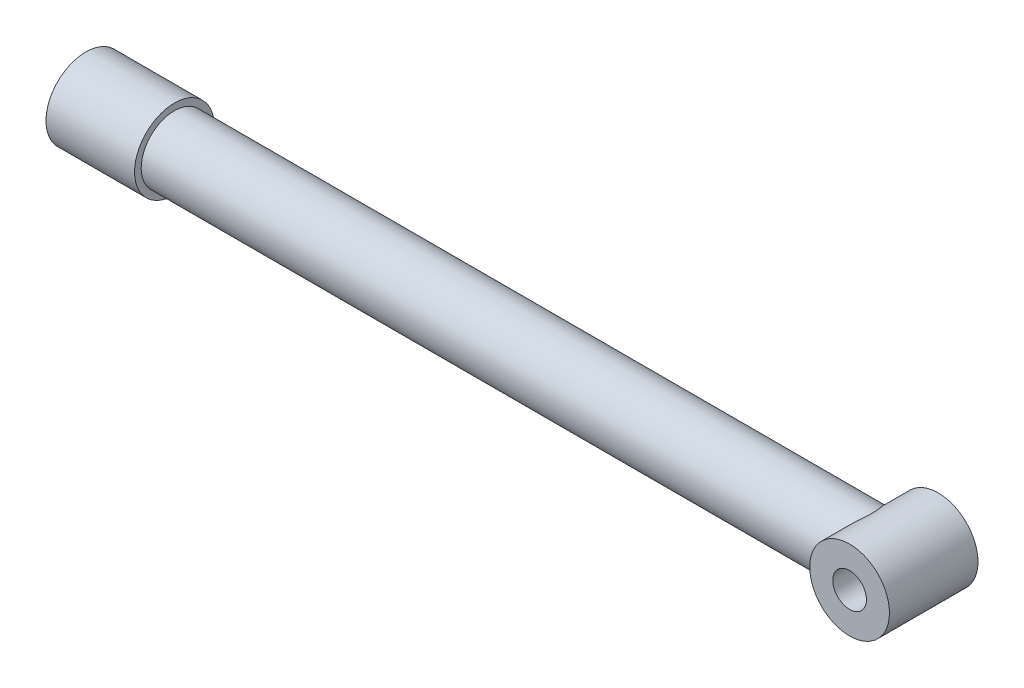
ISO-10303-21;
HEADER;
FILE_DESCRIPTION(('STEP AP214'),'2;1');
FILE_NAME('part.step','',(''),(''),'','','');
FILE_SCHEMA(('AUTOMOTIVE_DESIGN { 1 0 10303 214 1 1 1 1 }'));
ENDSEC;
DATA;
#1=APPLICATION_CONTEXT('core data for automotive mechanical design processes');
#2=APPLICATION_PROTOCOL_DEFINITION('international standard','automotive_design',2000,#1);
#3=PRODUCT_CONTEXT('',#1,'mechanical');
#4=PRODUCT('Part','Part','',(#3));
#5=PRODUCT_RELATED_PRODUCT_CATEGORY('part','',(#4));
#6=PRODUCT_DEFINITION_FORMATION('','',#4);
#7=PRODUCT_DEFINITION_CONTEXT('part definition',#1,'design');
#8=PRODUCT_DEFINITION('design','',#6,#7);
#9=PRODUCT_DEFINITION_SHAPE('','',#8);
#10=(LENGTH_UNIT() NAMED_UNIT(*) SI_UNIT(.MILLI.,.METRE.));
#11=(NAMED_UNIT(*) PLANE_ANGLE_UNIT() SI_UNIT($,.RADIAN.));
#12=(NAMED_UNIT(*) SI_UNIT($,.STERADIAN.) SOLID_ANGLE_UNIT());
#13=UNCERTAINTY_MEASURE_WITH_UNIT(LENGTH_MEASURE(1.E-05),#10,'distance_accuracy_value','');
#14=(GEOMETRIC_REPRESENTATION_CONTEXT(3) GLOBAL_UNCERTAINTY_ASSIGNED_CONTEXT((#13)) GLOBAL_UNIT_ASSIGNED_CONTEXT((#10,
#11,#12)) REPRESENTATION_CONTEXT('',''));
#15=CARTESIAN_POINT('',(0.,0.,0.));
#16=DIRECTION('',(0.,0.,1.));
#17=DIRECTION('',(1.,0.,0.));
#18=AXIS2_PLACEMENT_3D('',#15,#16,#17);
#19=CARTESIAN_POINT('',(0.,0.,0.));
#20=DIRECTION('',(-1.,0.,0.));
#21=DIRECTION('',(0.,0.,1.));
#22=AXIS2_PLACEMENT_3D('',#19,#20,#21);
#23=CYLINDRICAL_SURFACE('',#22,74.9999999999999);
#24=CARTESIAN_POINT('',(200.,0.,0.));
#25=DIRECTION('',(-1.,0.,0.));
#26=DIRECTION('',(0.,0.,1.));
#27=AXIS2_PLACEMENT_3D('',#24,#25,#26);
#28=CIRCLE('',#27,74.9999999999998);
#29=CARTESIAN_POINT('',(200.,0.,74.9999999999998));
#30=VERTEX_POINT('',#29);
#31=EDGE_CURVE('E75',#30,#30,#28,.T.);
#32=ORIENTED_EDGE('',*,*,#31,.F.);
#33=EDGE_LOOP('',(#32));
#34=FACE_BOUND('',#33,.T.);
#35=CARTESIAN_POINT('',(1735.,0.,74.9999999999999));
#36=CARTESIAN_POINT('',(1734.99999360583,-0.890858190399727,75.0000065646722));
#37=CARTESIAN_POINT('',(1735.01323031132,-1.78161747456993,74.9841248691935));
#38=CARTESIAN_POINT('',(1735.06608378754,-3.56130165667878,74.9206889799177));
#39=CARTESIAN_POINT('',(1735.10570136396,-4.45022649776036,74.8731338187884));
#40=CARTESIAN_POINT('',(1735.21109256045,-6.22429711760517,74.7465659055419));
#41=CARTESIAN_POINT('',(1735.27686726269,-7.10944273848357,74.6675518519125));
#42=CARTESIAN_POINT('',(1735.43419456346,-8.8741941597848,74.4784281526015));
#43=CARTESIAN_POINT('',(1735.52574981914,-9.75379937961504,74.3683153016503));
#44=CARTESIAN_POINT('',(1735.73416601095,-11.506076235497,74.1174338093881));
#45=CARTESIAN_POINT('',(1735.85104014988,-12.3787440068796,73.976649173745));
#46=CARTESIAN_POINT('',(1736.1094143992,-14.1150336707013,73.6650784792843));
#47=CARTESIAN_POINT('',(1736.25091480626,-14.9786554540311,73.4942920590372));
#48=CARTESIAN_POINT('',(1736.55777641808,-16.6953101071805,73.1234418807301));
#49=CARTESIAN_POINT('',(1736.72313791858,-17.5483428456103,72.923377759783));
#50=CARTESIAN_POINT('',(1737.07684267974,-19.2423239443599,72.4948014240871));
#51=CARTESIAN_POINT('',(1737.26518404675,-20.0832732940225,72.2662915533458));
#52=CARTESIAN_POINT('',(1737.66271497347,-21.7468532308557,71.7831462871858));
#53=CARTESIAN_POINT('',(1737.8717721111,-22.5695636526596,71.528676561624));
#54=CARTESIAN_POINT('',(1738.31067215743,-24.2006974064371,70.9934013086573));
#55=CARTESIAN_POINT('',(1738.54051427756,-25.0091212790517,70.7125967803786));
#56=CARTESIAN_POINT('',(1739.01993787583,-26.6106650288915,70.1255999616395));
#57=CARTESIAN_POINT('',(1739.26951755543,-27.4037862923645,69.8194099842584));
#58=CARTESIAN_POINT('',(1739.78738124022,-28.974012092462,69.1825462945913));
#59=CARTESIAN_POINT('',(1740.05566790227,-29.7511143335952,68.8518691040929));
#60=CARTESIAN_POINT('',(1740.88691315375,-32.0570989227339,67.8245798697947));
#61=CARTESIAN_POINT('',(1741.47634089138,-33.5609374024449,67.092607722516));
#62=CARTESIAN_POINT('',(1742.71682216724,-36.4968446350139,65.5418794086295));
#63=CARTESIAN_POINT('',(1743.36788879465,-37.9288980449343,64.7231048048535));
#64=CARTESIAN_POINT('',(1744.50850021663,-40.2770772470809,63.2772594319828));
#65=CARTESIAN_POINT('',(1744.9840525341,-41.2132051748074,62.6713964824808));
#66=CARTESIAN_POINT('',(1745.95693626331,-43.0496630137539,61.4244094286059));
#67=CARTESIAN_POINT('',(1746.45426305636,-43.9500004400911,60.7832927947344));
#68=CARTESIAN_POINT('',(1747.46821273861,-45.7149672911473,59.467252160506));
#69=CARTESIAN_POINT('',(1747.98484296362,-46.579582872336,58.7923152736661));
#70=CARTESIAN_POINT('',(1749.03452819888,-48.272550474702,57.410407583937));
#71=CARTESIAN_POINT('',(1749.5675841317,-49.1009004526405,56.7034349806798));
#72=CARTESIAN_POINT('',(1750.64871248675,-50.7231558019671,55.2570839545224));
#73=CARTESIAN_POINT('',(1751.19681878034,-51.516970939548,54.5176297259359));
#74=CARTESIAN_POINT('',(1752.30402576862,-53.0679106262517,53.0091229817846));
#75=CARTESIAN_POINT('',(1752.86312630644,-53.8250356983419,52.240070888378));
#76=CARTESIAN_POINT('',(1753.98945934437,-55.3024941253849,50.6733987578555));
#77=CARTESIAN_POINT('',(1754.55669069899,-56.0228325989228,49.8757827216218));
#78=CARTESIAN_POINT('',(1755.69648984487,-57.4268322392658,48.2525696955304));
#79=CARTESIAN_POINT('',(1756.269057691,-58.1104930284205,47.4269724177076));
#80=CARTESIAN_POINT('',(1757.42706481228,-59.4533332062403,45.7328212185813));
#81=CARTESIAN_POINT('',(1758.01254713861,-60.1118310733573,44.8637565097349));
#82=CARTESIAN_POINT('',(1759.18252162071,-61.3906390174382,43.0973130712857));
#83=CARTESIAN_POINT('',(1759.76701376978,-62.0109488365384,42.1999341505538));
#84=CARTESIAN_POINT('',(1760.93151271706,-63.2133656849564,40.3765216512356));
#85=CARTESIAN_POINT('',(1761.51151788179,-63.7954593302255,39.4504781990893));
#86=CARTESIAN_POINT('',(1762.66273366669,-64.9208217946784,37.5697722119378));
#87=CARTESIAN_POINT('',(1763.23394439402,-65.464091087166,36.6151100260222));
#88=CARTESIAN_POINT('',(1764.36162318151,-66.5099780569317,34.6789646249734));
#89=CARTESIAN_POINT('',(1764.91812309669,-67.0126894173575,33.6975506593872));
#90=CARTESIAN_POINT('',(1766.01259151048,-67.9780705481447,31.7050083421357));
#91=CARTESIAN_POINT('',(1766.55055902474,-68.4407381935595,30.6938784173825));
#92=CARTESIAN_POINT('',(1767.6015402537,-69.3245110484923,28.641912652945));
#93=CARTESIAN_POINT('',(1768.11457146629,-69.7456456218262,27.6010984809572));
#94=CARTESIAN_POINT('',(1769.10904454888,-70.5450782887257,25.4885689197051));
#95=CARTESIAN_POINT('',(1769.59049218487,-70.9233842104176,24.416859222531));
#96=CARTESIAN_POINT('',(1770.5574095196,-71.6687596560138,22.1394732679743));
#97=CARTESIAN_POINT('',(1771.03899181122,-72.0314193841978,20.9306826994214));
#98=CARTESIAN_POINT('',(1771.94293478505,-72.6998210753984,18.4757639197167));
#99=CARTESIAN_POINT('',(1772.36530346877,-73.0055707304649,17.2296407809617));
#100=CARTESIAN_POINT('',(1773.13693408139,-73.5557394522424,14.7043907038731));
#101=CARTESIAN_POINT('',(1773.48634608819,-73.800284631767,13.4253377207366));
#102=CARTESIAN_POINT('',(1774.09970651544,-74.2246571135214,10.836084770843));
#103=CARTESIAN_POINT('',(1774.36365566694,-74.4044849693383,9.52588507061465));
#104=CARTESIAN_POINT('',(1774.79653935441,-74.6972714236726,6.86516424967096));
#105=CARTESIAN_POINT('',(1774.96424204964,-74.8093640104216,5.51434361386447));
#106=CARTESIAN_POINT('',(1775.19027944435,-74.9600601783092,2.79947489969748));
#107=CARTESIAN_POINT('',(1775.2486243704,-74.998670631117,1.43542807017393));
#108=CARTESIAN_POINT('',(1775.25252985381,-75.0012616664914,-1.29291241333085));
#109=CARTESIAN_POINT('',(1775.19809016812,-74.9652420882301,-2.65720606783765));
#110=CARTESIAN_POINT('',(1774.97964633137,-74.8196560474258,-5.37300505572056));
#111=CARTESIAN_POINT('',(1774.81562883437,-74.7100806262076,-6.72450881102561));
#112=CARTESIAN_POINT('',(1774.3691886328,-74.4083266087523,-9.5147385123352));
#113=CARTESIAN_POINT('',(1774.07807142965,-74.2100490868164,-10.9513982271858));
#114=CARTESIAN_POINT('',(1773.39396190408,-73.7359412315258,-13.7869111174389));
#115=CARTESIAN_POINT('',(1773.00095353118,-73.4600986790968,-15.1857582980199));
#116=CARTESIAN_POINT('',(1772.12966628761,-72.8355372784456,-17.9440910715829));
#117=CARTESIAN_POINT('',(1771.65114923319,-72.4866143859322,-19.3034540590487));
#118=CARTESIAN_POINT('',(1770.62667668022,-71.7213368858453,-21.9768898118502));
#119=CARTESIAN_POINT('',(1770.08071469034,-71.3049757864051,-23.2909582021653));
#120=CARTESIAN_POINT('',(1769.05415180929,-70.5010334959811,-25.6082712728805));
#121=CARTESIAN_POINT('',(1768.58317147396,-70.1251176212857,-26.6199023384864));
#122=CARTESIAN_POINT('',(1767.61472209306,-69.3348428384365,-28.6152262356151));
#123=CARTESIAN_POINT('',(1767.11724967575,-68.9204790318601,-29.5989154863273));
#124=CARTESIAN_POINT('',(1766.10140958134,-68.054403535938,-31.5393012510223));
#125=CARTESIAN_POINT('',(1765.58303197648,-67.6026739921706,-32.495984564529));
#126=CARTESIAN_POINT('',(1764.53064296829,-66.6629920016483,-34.3824943000731));
#127=CARTESIAN_POINT('',(1763.99663213984,-66.1750408858584,-35.3123217071909));
#128=CARTESIAN_POINT('',(1762.91663413555,-65.1629048195095,-37.146935947218));
#129=CARTESIAN_POINT('',(1762.37063186522,-64.6386721750583,-38.0516875429799));
#130=CARTESIAN_POINT('',(1761.27124312282,-63.5550259675181,-39.83525460095));
#131=CARTESIAN_POINT('',(1760.71785660937,-62.9956122072284,-40.714069917737));
#132=CARTESIAN_POINT('',(1759.60731482995,-61.8420377136799,-42.4457831502217));
#133=CARTESIAN_POINT('',(1759.050160401,-61.2478844870307,-43.2986866049474));
#134=CARTESIAN_POINT('',(1757.93513655507,-60.0249021311513,-44.978780655172));
#135=CARTESIAN_POINT('',(1757.37726713409,-59.3960728065933,-45.8059711057904));
#136=CARTESIAN_POINT('',(1756.23459491895,-58.0699981275553,-47.4770666909604));
#137=CARTESIAN_POINT('',(1755.64991106872,-57.3708945105391,-48.3195797890107));
#138=CARTESIAN_POINT('',(1754.48620911338,-55.9344236448117,-49.9754092883336));
#139=CARTESIAN_POINT('',(1753.90719103005,-55.1970562490158,-50.7887255773544));
#140=CARTESIAN_POINT('',(1752.75778966588,-53.6839441209614,-52.3855336083897));
#141=CARTESIAN_POINT('',(1752.1874077526,-52.9081933918887,-53.1690206559871));
#142=CARTESIAN_POINT('',(1751.05833399707,-51.3184235799533,-54.7050369973918));
#143=CARTESIAN_POINT('',(1750.4996423167,-50.5044039676804,-55.4575658626546));
#144=CARTESIAN_POINT('',(1749.3978897704,-48.8396906219057,-56.9290475503942));
#145=CARTESIAN_POINT('',(1748.85480217139,-47.989066727207,-57.6480592961789));
#146=CARTESIAN_POINT('',(1747.7861288759,-46.2499696110202,-59.0524292634196));
#147=CARTESIAN_POINT('',(1747.26054205602,-45.3614988273463,-59.7377896463422));
#148=CARTESIAN_POINT('',(1746.22994301304,-43.5472844076407,-61.072922891836));
#149=CARTESIAN_POINT('',(1745.72492277715,-42.6215555723935,-61.7227096485994));
#150=CARTESIAN_POINT('',(1744.73808287952,-40.732793060747,-62.9851592453571));
#151=CARTESIAN_POINT('',(1744.25626893399,-39.7697502974676,-63.5978129481832));
#152=CARTESIAN_POINT('',(1743.07954962281,-37.3060044479162,-65.0865706523571));
#153=CARTESIAN_POINT('',(1742.40145236073,-35.781845527402,-65.9374689284979));
#154=CARTESIAN_POINT('',(1741.11581347358,-32.6542503976722,-67.5409966580156));
#155=CARTESIAN_POINT('',(1740.50825519976,-31.0508330230893,-68.2936493047488));
#156=CARTESIAN_POINT('',(1739.65771551319,-28.5910455205154,-69.3422461607241));
#157=CARTESIAN_POINT('',(1739.38433953401,-27.7620212523806,-69.6783761950588));
#158=CARTESIAN_POINT('',(1738.85907711185,-26.0866191634127,-70.3227806768454));
#159=CARTESIAN_POINT('',(1738.60718719172,-25.2402441780989,-70.6310596319965));
#160=CARTESIAN_POINT('',(1738.12608554902,-23.5310714172204,-71.2187157472113));
#161=CARTESIAN_POINT('',(1737.89687606179,-22.6682720328798,-71.4980900586283));
#162=CARTESIAN_POINT('',(1737.46233461677,-20.9275386050973,-72.0268391168136));
#163=CARTESIAN_POINT('',(1737.25700369427,-20.0496039073426,-72.2762125628818));
#164=CARTESIAN_POINT('',(1736.86984925125,-18.273185584629,-72.7457301076251));
#165=CARTESIAN_POINT('',(1736.68822087041,-17.3745952745065,-72.9656319263471));
#166=CARTESIAN_POINT('',(1736.35141205953,-15.5651753141046,-73.3729190900226));
#167=CARTESIAN_POINT('',(1736.19623120411,-14.6543458609261,-73.5603049579436));
#168=CARTESIAN_POINT('',(1735.91324212529,-12.8221990613449,-73.9016883798035));
#169=CARTESIAN_POINT('',(1735.78543466866,-11.9008814219109,-74.0556849984528));
#170=CARTESIAN_POINT('',(1735.55799265563,-10.0497231203051,-74.3295263948367));
#171=CARTESIAN_POINT('',(1735.45835809442,-9.11988245959037,-74.4493711784096));
#172=CARTESIAN_POINT('',(1735.2879433958,-7.25423036558703,-74.6542452413002));
#173=CARTESIAN_POINT('',(1735.21714828022,-6.31842228872229,-74.7392925932404));
#174=CARTESIAN_POINT('',(1735.10480001124,-4.44251327578992,-74.8742170433437));
#175=CARTESIAN_POINT('',(1735.06324704964,-3.50241231160288,-74.9240939107985));
#176=CARTESIAN_POINT('',(1735.00966118274,-1.62024793990289,-74.9884084095682));
#177=CARTESIAN_POINT('',(1734.99762550467,-0.67818472503879,-75.0028493696179));
#178=CARTESIAN_POINT('',(1735.00314751349,1.20571287057665,-74.9962230077101));
#179=CARTESIAN_POINT('',(1735.02070434409,2.1475472571606,-74.975156713175));
#180=CARTESIAN_POINT('',(1735.0814120306,3.915801589101,-74.902288367009));
#181=CARTESIAN_POINT('',(1735.12123772839,4.7425049293008,-74.8544792297342));
#182=CARTESIAN_POINT('',(1735.22350810366,6.39255905124008,-74.7316509767426));
#183=CARTESIAN_POINT('',(1735.28595468038,7.2159095456069,-74.6566295763128));
#184=CARTESIAN_POINT('',(1735.43313714074,8.85754567030661,-74.4796974451217));
#185=CARTESIAN_POINT('',(1735.51786869054,9.67583225380561,-74.3777919426208));
#186=CARTESIAN_POINT('',(1735.70921471405,11.306166983224,-74.1474776515776));
#187=CARTESIAN_POINT('',(1735.81583131499,12.1182145147416,-74.0190662866592));
#188=CARTESIAN_POINT('',(1736.05042431236,13.7346212369416,-73.7362411782231));
#189=CARTESIAN_POINT('',(1736.17839960885,14.5389808212789,-73.5818287736866));
#190=CARTESIAN_POINT('',(1736.45510821168,16.138819817097,-73.247570694004));
#191=CARTESIAN_POINT('',(1736.60384336248,16.9342984327267,-73.0677227589291));
#192=CARTESIAN_POINT('',(1737.08018032076,19.3055196571069,-72.4909786239117));
#193=CARTESIAN_POINT('',(1737.43796239014,20.8663809435798,-72.0568234542264));
#194=CARTESIAN_POINT('',(1738.23303894434,23.9599582851523,-71.0885564508912));
#195=CARTESIAN_POINT('',(1738.67132665717,25.4920249018549,-70.5531932531738));
#196=CARTESIAN_POINT('',(1739.38049267166,27.74746263732,-69.6830550274554));
#197=CARTESIAN_POINT('',(1739.62551533968,28.4921957982151,-69.3818123913277));
#198=CARTESIAN_POINT('',(1740.13194454816,29.9669996816855,-68.7576912411989));
#199=CARTESIAN_POINT('',(1740.39335310258,30.6970685872745,-68.4348100672901));
#200=CARTESIAN_POINT('',(1741.20074396773,32.8642822380754,-67.434932849334));
#201=CARTESIAN_POINT('',(1741.76992861234,34.2785512900032,-66.7266576536846));
#202=CARTESIAN_POINT('',(1742.96253732782,37.0421482728449,-65.2330248794708));
#203=CARTESIAN_POINT('',(1743.58597227886,38.3914630921845,-64.4476518344722));
#204=CARTESIAN_POINT('',(1744.70151640257,40.6605833424829,-63.0315848410118));
#205=CARTESIAN_POINT('',(1745.18258190864,41.5964456853992,-62.4177623776756));
#206=CARTESIAN_POINT('',(1746.16632998576,43.4319745220933,-61.1547578566969));
#207=CARTESIAN_POINT('',(1746.66900868259,44.3316474473926,-60.5055821306778));
#208=CARTESIAN_POINT('',(1747.69347374999,46.094914610935,-59.1733085502858));
#209=CARTESIAN_POINT('',(1748.21526802881,46.9584935932191,-58.4901966136917));
#210=CARTESIAN_POINT('',(1749.27503129004,48.6489914597185,-57.0918469824338));
#211=CARTESIAN_POINT('',(1749.81300104452,49.4759085893232,-56.3766077534712));
#212=CARTESIAN_POINT('',(1750.90385645663,51.0951775790398,-54.9133587140955));
#213=CARTESIAN_POINT('',(1751.45677957178,51.8874264673553,-54.1652629693572));
#214=CARTESIAN_POINT('',(1752.57329334488,53.4348427224347,-52.6393231340171));
#215=CARTESIAN_POINT('',(1753.13688387533,54.1900105320211,-51.8614793988637));
#216=CARTESIAN_POINT('',(1754.27180384136,55.6631535627925,-50.2770654234478));
#217=CARTESIAN_POINT('',(1754.84313206323,56.3811345336732,-49.470499656823));
#218=CARTESIAN_POINT('',(1755.99067563225,57.7800275113222,-47.829187293026));
#219=CARTESIAN_POINT('',(1756.56689102636,58.460939161401,-46.9944404248141));
#220=CARTESIAN_POINT('',(1757.73143991024,59.7974950364994,-45.2820089720696));
#221=CARTESIAN_POINT('',(1758.31980575609,60.4524691966841,-44.4038233670543));
#222=CARTESIAN_POINT('',(1759.49490411792,61.7238340470819,-42.6188801400728));
#223=CARTESIAN_POINT('',(1760.08163662215,62.3402244602702,-41.7121223130329));
#224=CARTESIAN_POINT('',(1761.24987194808,63.5343929701284,-39.8696200497105));
#225=CARTESIAN_POINT('',(1761.83137272344,64.1121564817817,-38.9338648574026));
#226=CARTESIAN_POINT('',(1762.98467179164,65.2283912561971,-37.0333827618349));
#227=CARTESIAN_POINT('',(1763.5564702105,65.7668630295438,-36.0686562352791));
#228=CARTESIAN_POINT('',(1764.6840736774,66.8024956162222,-34.112289589846));
#229=CARTESIAN_POINT('',(1765.23991733132,67.2997628313288,-33.1207281578333));
#230=CARTESIAN_POINT('',(1766.33178595126,68.2536898603624,-31.1074701928449));
#231=CARTESIAN_POINT('',(1766.86780979369,68.710347374173,-30.0857719572923));
#232=CARTESIAN_POINT('',(1767.91332832775,69.5814234141006,-28.0123014447488));
#233=CARTESIAN_POINT('',(1768.42284301551,69.9958740100996,-26.9605527908332));
#234=CARTESIAN_POINT('',(1769.40843244053,70.7811739566228,-24.8257655359758));
#235=CARTESIAN_POINT('',(1769.88451371592,71.1520318416025,-23.7427331115758));
#236=CARTESIAN_POINT('',(1770.831149632,71.8757130808422,-21.4576266149494));
#237=CARTESIAN_POINT('',(1771.29827305436,72.2247749916504,-20.2529226086267));
#238=CARTESIAN_POINT('',(1772.1720957267,72.8663607554869,-17.8070606774411));
#239=CARTESIAN_POINT('',(1772.57880330202,73.1588924001079,-16.5659078035466));
#240=CARTESIAN_POINT('',(1773.31813005963,73.6830345684437,-14.0518728803488));
#241=CARTESIAN_POINT('',(1773.65090646223,73.9147745638728,-12.7790646888049));
#242=CARTESIAN_POINT('',(1774.23046187404,74.3140521438726,-10.2038622975775));
#243=CARTESIAN_POINT('',(1774.47724192084,74.4815905030862,-8.90146845506904));
#244=CARTESIAN_POINT('',(1774.87561623858,74.7502856576446,-6.25924931851869));
#245=CARTESIAN_POINT('',(1775.0260498954,74.8506336915455,-4.91916347704064));
#246=CARTESIAN_POINT('',(1775.21885650995,74.9790072406208,-2.22777280448192));
#247=CARTESIAN_POINT('',(1775.26123854009,75.0070388277551,-0.876468924868412));
#248=CARTESIAN_POINT('',(1775.23549749281,74.9899626752168,1.82490985025215));
#249=CARTESIAN_POINT('',(1775.16735013411,74.9448388646474,3.17498441050576));
#250=CARTESIAN_POINT('',(1774.92443621814,74.7827432489087,5.86111843644855));
#251=CARTESIAN_POINT('',(1774.7496555748,74.6657619514844,7.1971760267998));
#252=CARTESIAN_POINT('',(1774.27894842312,74.3469152143914,9.98543407262301));
#253=CARTESIAN_POINT('',(1773.97212632,74.1373536186976,11.4348979464841));
#254=CARTESIAN_POINT('',(1773.25632380938,73.6395340772299,14.29429682411));
#255=CARTESIAN_POINT('',(1772.84732480814,73.3512618071235,15.7042245812581));
#256=CARTESIAN_POINT('',(1771.94437757315,72.700832023437,18.4832863979606));
#257=CARTESIAN_POINT('',(1771.45019415343,72.3384694237424,19.8522948663122));
#258=CARTESIAN_POINT('',(1770.39512742583,71.5453918521927,22.5438660969454));
#259=CARTESIAN_POINT('',(1769.83423822609,71.1146708413795,23.8664247431111));
#260=CARTESIAN_POINT('',(1768.78113207339,70.2836579654289,26.1994538324334));
#261=CARTESIAN_POINT('',(1768.29832212241,69.8951507145907,27.2184451928627));
#262=CARTESIAN_POINT('',(1767.30679651048,69.0789875882514,29.2278911188011));
#263=CARTESIAN_POINT('',(1766.7980775787,68.6513267644337,30.2183420564532));
#264=CARTESIAN_POINT('',(1765.76037883652,67.757924536969,32.171690478186));
#265=CARTESIAN_POINT('',(1765.23138945403,67.2921650216322,33.1345745602039));
#266=CARTESIAN_POINT('',(1764.15845699049,66.323668094574,35.0329333938733));
#267=CARTESIAN_POINT('',(1763.61451445833,65.8209320390324,35.9684091490156));
#268=CARTESIAN_POINT('',(1762.51536088157,64.7784256080526,37.8137552548451));
#269=CARTESIAN_POINT('',(1761.96013578933,64.2386067837216,38.7235898306171));
#270=CARTESIAN_POINT('',(1760.84305679917,63.1229737039889,40.5167270268659));
#271=CARTESIAN_POINT('',(1760.28120286153,62.5471592327492,41.4000294882033));
#272=CARTESIAN_POINT('',(1759.15452440796,61.3599458353983,43.1400752768837));
#273=CARTESIAN_POINT('',(1758.58970055251,60.7485545400266,43.9968242396085));
#274=CARTESIAN_POINT('',(1757.4601836346,59.4902348489063,45.6839068361607));
#275=CARTESIAN_POINT('',(1756.89549057269,58.8433063089715,46.5142403627906));
#276=CARTESIAN_POINT('',(1755.74153112804,57.481299974877,48.1883924109552));
#277=CARTESIAN_POINT('',(1755.15242164698,56.7644353655917,49.0308666783466));
#278=CARTESIAN_POINT('',(1753.98088673746,55.2916898274977,50.6858561253578));
#279=CARTESIAN_POINT('',(1753.39846137037,54.5358085408526,51.498371030092));
#280=CARTESIAN_POINT('',(1752.24334738606,52.9849458340759,53.0926772422969));
#281=CARTESIAN_POINT('',(1751.67065991307,52.1899598611389,53.8744649531675));
#282=CARTESIAN_POINT('',(1750.53806802618,50.5609034086353,55.4061833672287));
#283=CARTESIAN_POINT('',(1749.97816502953,49.7268286267752,56.1561105463025));
#284=CARTESIAN_POINT('',(1748.87526932998,48.0213974385445,57.6212347641257));
#285=CARTESIAN_POINT('',(1748.33224627398,47.1501155487552,58.3364956109421));
#286=CARTESIAN_POINT('',(1747.26499316425,45.3690042638806,59.7321813067613));
#287=CARTESIAN_POINT('',(1746.74076262265,44.4591758708069,60.4126070602837));
#288=CARTESIAN_POINT('',(1745.7142330856,42.6015593826238,61.7365983294859));
#289=CARTESIAN_POINT('',(1745.21192769807,41.6537825076299,62.3801746055703));
#290=CARTESIAN_POINT('',(1744.23218891478,39.7207117135541,63.628522277774));
#291=CARTESIAN_POINT('',(1743.7547536168,38.7354206738001,64.2332966425311));
#292=CARTESIAN_POINT('',(1742.60443003221,36.2443527742644,65.6833934744148));
#293=CARTESIAN_POINT('',(1741.94817262658,34.7164780728101,66.5042605817841));
#294=CARTESIAN_POINT('',(1740.70707674385,31.5838570468608,68.0478317961649));
#295=CARTESIAN_POINT('',(1740.12223152284,29.9791180011214,68.770545173193));
#296=CARTESIAN_POINT('',(1739.30643617243,27.5201546200804,69.7740968800167));
#297=CARTESIAN_POINT('',(1739.04483996042,26.6921910767775,70.0950847542024));
#298=CARTESIAN_POINT('',(1738.54319623126,25.0196522071403,70.7093372794465));
#299=CARTESIAN_POINT('',(1738.30314662715,24.1750784993246,71.0026046156234));
#300=CARTESIAN_POINT('',(1737.84578175223,22.4704453630091,71.5603467554634));
#301=CARTESIAN_POINT('',(1737.62846535666,21.6103867031276,71.8248229836485));
#302=CARTESIAN_POINT('',(1737.21768657198,19.8761111699739,72.3239560406934));
#303=CARTESIAN_POINT('',(1737.02422327099,19.0018948393754,72.5586140094728));
#304=CARTESIAN_POINT('',(1736.54286323004,16.660087175569,73.1416941525058));
#305=CARTESIAN_POINT('',(1736.27675431542,15.1811243093772,73.4631769738318));
#306=CARTESIAN_POINT('',(1735.8173528209,12.1957506827363,74.0173529805729));
#307=CARTESIAN_POINT('',(1735.62405079414,10.68934350986,74.2500576852072));
#308=CARTESIAN_POINT('',(1735.31340448842,7.65745674107267,74.6236972907827));
#309=CARTESIAN_POINT('',(1735.1960568606,6.13197798905995,74.7646362377219));
#310=CARTESIAN_POINT('',(1735.03935543385,3.07090236753309,74.9527875744933));
#311=CARTESIAN_POINT('',(1735.00001101971,1.53530430283094,74.9999886864489));
#312=CARTESIAN_POINT('',(1735.,0.,74.9999999999999));
#313=B_SPLINE_CURVE_WITH_KNOTS('',3,(#35,#36,#37,#38,#39,#40,#41,#42,#43,#44,#45,#46,#47,#48,
#49,#50,#51,#52,#53,#54,#55,#56,#57,#58,#59,#60,#61,#62,#63,#64,#65,#66,#67,#68,#69,#70,#71,#72,
#73,#74,#75,#76,#77,#78,#79,#80,#81,#82,#83,#84,#85,#86,#87,#88,#89,#90,#91,#92,#93,#94,#95,#96,
#97,#98,#99,#100,#101,#102,#103,#104,#105,#106,#107,#108,#109,#110,#111,#112,#113,#114,#115,
#116,#117,#118,#119,#120,#121,#122,#123,#124,#125,#126,#127,#128,#129,#130,#131,#132,#133,#134,
#135,#136,#137,#138,#139,#140,#141,#142,#143,#144,#145,#146,#147,#148,#149,#150,#151,#152,#153,
#154,#155,#156,#157,#158,#159,#160,#161,#162,#163,#164,#165,#166,#167,#168,#169,#170,#171,#172,
#173,#174,#175,#176,#177,#178,#179,#180,#181,#182,#183,#184,#185,#186,#187,#188,#189,#190,#191,
#192,#193,#194,#195,#196,#197,#198,#199,#200,#201,#202,#203,#204,#205,#206,#207,#208,#209,#210,
#211,#212,#213,#214,#215,#216,#217,#218,#219,#220,#221,#222,#223,#224,#225,#226,#227,#228,#229,
#230,#231,#232,#233,#234,#235,#236,#237,#238,#239,#240,#241,#242,#243,#244,#245,#246,#247,#248,
#249,#250,#251,#252,#253,#254,#255,#256,#257,#258,#259,#260,#261,#262,#263,#264,#265,#266,#267,
#268,#269,#270,#271,#272,#273,#274,#275,#276,#277,#278,#279,#280,#281,#282,#283,#284,#285,#286,
#287,#288,#289,#290,#291,#292,#293,#294,#295,#296,#297,#298,#299,#300,#301,#302,#303,#304,#305,
#306,#307,#308,#309,#310,#311,#312),.UNSPECIFIED.,.T.,.F.,(4,2,2,2,2,2,2,2,2,2,2,2,2,2,2,2,2,2,
2,2,2,2,2,2,2,2,2,2,2,2,2,2,2,2,2,2,2,2,2,2,2,2,2,2,2,2,2,2,2,2,2,2,2,2,2,2,2,2,2,2,2,2,2,2,2,2,
2,2,2,2,2,2,2,2,2,2,2,2,2,2,2,2,2,2,2,2,2,2,2,2,2,2,2,2,2,2,2,2,2,2,2,2,2,2,2,2,2,2,2,2,2,2,2,2,
2,2,2,2,2,2,2,2,2,2,2,2,2,2,2,2,2,2,2,2,2,2,2,2,4),(0.,2.67216416265691,5.34440993901757,
8.01676628259472,10.6893981593524,13.3634270763591,16.0374882094253,18.711582489381,
21.3854565623436,24.0432234587753,26.7008895619219,29.3583137685985,32.0161161678083,
37.3307989796573,42.646612920445,46.2821944679082,49.9170085571638,53.5532183049228,
57.1896326572577,60.8350385726247,64.480392512352,68.1252378380544,71.7701206855713,
75.4820402668571,79.1939849100034,82.90722268914,86.6204151928261,90.3247693620706,
94.0293199849669,97.7312324327156,101.432467156933,105.482105851445,109.531196792687,
113.571874524974,117.612517692802,121.7037848456,125.794669385445,129.885562741164,
133.976954434394,138.407787287454,142.839318535601,147.283391860394,151.727893243682,
155.259157191809,158.790871656672,162.324283534002,165.857565639994,169.395584035365,
172.933622264165,176.470898788219,180.008195239517,183.730675039042,187.453169148705,
191.176246689469,194.899375750308,198.615691570316,202.331768373884,206.046383258997,
209.761908503049,215.374550724194,220.985865534098,223.791423741609,226.596527052766,
229.40190655319,232.207407638232,235.034717002629,237.861980890027,240.689323963673,
243.516666553992,246.342538847423,249.168429677597,251.994055042537,254.819598647822,
257.305976853202,259.792563860612,262.278667647364,264.765013197861,267.251230747606,
269.737669334941,274.709523847635,279.74743306671,282.266603228135,284.786083627458,
289.824651679053,294.864232580594,298.517667045482,302.170449333483,305.82476025709,
309.47924588508,313.143936658118,316.808583656728,320.472662338827,324.136776271312,
327.866448835432,331.596148174901,335.327247938271,339.058299208455,342.779394374324,
346.500700167394,350.219156984305,353.936884595652,357.949387808165,361.961337580432,
365.964672181974,369.96795847863,374.018604832133,378.068911067119,382.120107200543,
386.171838605381,390.653919675811,395.136816971753,399.632295378674,404.128171149028,
407.704809576241,411.281900652708,414.860702232596,418.439372619017,422.022810911748,
425.606270693641,429.188964685639,432.771673214853,436.530534229934,440.289429725055,
444.048763894314,447.808512809377,451.561055904236,455.313501511988,459.064845721568,
462.815902582045,468.373828482194,473.931229104832,476.707762067515,479.484025808274,
482.260152122981,485.036172277452,489.641624740836,494.246479429941,498.851131074953,
503.456336685688),.UNSPECIFIED.);
#314=CARTESIAN_POINT('',(1735.,0.,74.9999999999999));
#315=VERTEX_POINT('',#314);
#316=EDGE_CURVE('E11',#315,#315,#313,.T.);
#317=ORIENTED_EDGE('',*,*,#316,.F.);
#318=EDGE_LOOP('',(#317));
#319=FACE_BOUND('',#318,.T.);
#320=ADVANCED_FACE('F33',(#34,#319),#23,.T.);
#321=CARTESIAN_POINT('',(0.,0.,0.));
#322=DIRECTION('',(-1.,0.,0.));
#323=DIRECTION('',(0.,0.,1.));
#324=AXIS2_PLACEMENT_3D('',#321,#322,#323);
#325=CYLINDRICAL_SURFACE('',#324,50.9999999999995);
#326=CARTESIAN_POINT('',(0.,0.,0.));
#327=DIRECTION('',(-1.,0.,0.));
#328=DIRECTION('',(0.,0.,1.));
#329=AXIS2_PLACEMENT_3D('',#326,#327,#328);
#330=CIRCLE('',#329,50.9999999999989);
#331=CARTESIAN_POINT('',(0.,0.,50.9999999999989));
#332=VERTEX_POINT('',#331);
#333=EDGE_CURVE('E66',#332,#332,#330,.T.);
#334=ORIENTED_EDGE('',*,*,#333,.T.);
#335=EDGE_LOOP('',(#334));
#336=FACE_BOUND('',#335,.T.);
#337=CARTESIAN_POINT('',(1750.,49.7493718553313,-11.2249721603179));
#338=CARTESIAN_POINT('',(1749.8952033153,49.5913628520777,-11.9253288343426));
#339=CARTESIAN_POINT('',(1749.7814686798,49.4188395714794,-12.6210200386141));
#340=CARTESIAN_POINT('',(1749.53750751067,49.0455147075413,-14.0017321957628));
#341=CARTESIAN_POINT('',(1749.40728351955,48.8447174832296,-14.6867547753884));
#342=CARTESIAN_POINT('',(1749.13184045356,48.4157731263372,-16.044287621711));
#343=CARTESIAN_POINT('',(1748.98663740515,48.187655183648,-16.7168103711649));
#344=CARTESIAN_POINT('',(1748.68259620364,47.7046678181159,-18.0490117726604));
#345=CARTESIAN_POINT('',(1748.5237575303,47.4497973745094,-18.7086899334668));
#346=CARTESIAN_POINT('',(1748.03046421585,46.648504472935,-20.6613224045983));
#347=CARTESIAN_POINT('',(1747.67794139938,46.0634187292058,-21.934118020456));
#348=CARTESIAN_POINT('',(1746.93664573265,44.7956670461627,-24.419161613437));
#349=CARTESIAN_POINT('',(1746.54786261535,44.1129734400651,-25.6313922916172));
#350=CARTESIAN_POINT('',(1745.74739453835,42.6580706704845,-27.9856379917374));
#351=CARTESIAN_POINT('',(1745.33580723342,41.8862298602213,-29.1279140777704));
#352=CARTESIAN_POINT('',(1744.4994489717,40.2554455865877,-31.3431133219757));
#353=CARTESIAN_POINT('',(1744.07467916968,39.3965097377663,-32.4160425296032));
#354=CARTESIAN_POINT('',(1743.22172010364,37.593998204418,-34.4903225785894));
#355=CARTESIAN_POINT('',(1742.79352626494,36.6502815611494,-35.4915490470691));
#356=CARTESIAN_POINT('',(1741.94448795291,34.6832733435696,-37.4160907765675));
#357=CARTESIAN_POINT('',(1741.52364403021,33.6599758384432,-38.339400220057));
#358=CARTESIAN_POINT('',(1740.66326567136,31.4459104876112,-40.179628449506));
#359=CARTESIAN_POINT('',(1740.225269149,30.2483140577951,-41.0890682607458));
#360=CARTESIAN_POINT('',(1739.38122203669,27.7693742261069,-42.8034096264909));
#361=CARTESIAN_POINT('',(1738.97517343752,26.4880256144533,-43.608304668497));
#362=CARTESIAN_POINT('',(1738.39887440972,24.5095372343277,-44.7309471185881));
#363=CARTESIAN_POINT('',(1738.21227596197,23.8407895315885,-45.0909719490137));
#364=CARTESIAN_POINT('',(1737.85125584562,22.4852833953449,-45.7819886455785));
#365=CARTESIAN_POINT('',(1737.67683268264,21.7985271864527,-46.1129840760113));
#366=CARTESIAN_POINT('',(1737.34145312926,20.4081038069848,-46.7449735808133));
#367=CARTESIAN_POINT('',(1737.18049722853,19.7044360227072,-47.0459665643813));
#368=CARTESIAN_POINT('',(1736.87330840583,18.2815704570178,-47.6169264388866));
#369=CARTESIAN_POINT('',(1736.72707341084,17.5623748796369,-47.8868976991324));
#370=CARTESIAN_POINT('',(1736.46002376118,16.1600212592967,-48.3773367054894));
#371=CARTESIAN_POINT('',(1736.33815058015,15.4778097873072,-48.5999366099905));
#372=CARTESIAN_POINT('',(1736.10901374307,14.1024292778489,-49.0167087783006));
#373=CARTESIAN_POINT('',(1736.00174812121,13.4092617288337,-49.2108848675068));
#374=CARTESIAN_POINT('',(1735.80257342386,12.0131728516068,-49.5701852826493));
#375=CARTESIAN_POINT('',(1735.71066595839,11.3102505091497,-49.7353065628504));
#376=CARTESIAN_POINT('',(1735.5429118806,9.8962712388079,-50.0358487645409));
#377=CARTESIAN_POINT('',(1735.46706332714,9.18521530504752,-50.1712732757419));
#378=CARTESIAN_POINT('',(1735.3320267489,7.75685902555454,-50.4118571069076));
#379=CARTESIAN_POINT('',(1735.27282897515,7.03956258831622,-50.5170341374412));
#380=CARTESIAN_POINT('',(1735.17149586043,5.60003852297784,-50.6968012989743));
#381=CARTESIAN_POINT('',(1735.12935842187,4.87781151220661,-50.7713951902143));
#382=CARTESIAN_POINT('',(1735.0624667961,3.43003306769605,-50.8897070979364));
#383=CARTESIAN_POINT('',(1735.03771217053,2.70448171825665,-50.9334258930478));
#384=CARTESIAN_POINT('',(1735.00577260811,1.25185868239882,-50.9898166506425));
#385=CARTESIAN_POINT('',(1734.99858715184,0.524787041562779,-51.002489530976));
#386=CARTESIAN_POINT('',(1735.00311656883,-1.48305222117422,-50.9945067408826));
#387=CARTESIAN_POINT('',(1735.03339042118,-2.76384970837366,-50.9411232009844));
#388=CARTESIAN_POINT('',(1735.14800422259,-5.31508385843989,-50.7384265241105));
#389=CARTESIAN_POINT('',(1735.23233898486,-6.5855215034249,-50.5891225900666));
#390=CARTESIAN_POINT('',(1735.45302426059,-9.10718527163409,-50.1964862746587));
#391=CARTESIAN_POINT('',(1735.5893744116,-10.3584115286603,-49.9531545484817));
#392=CARTESIAN_POINT('',(1735.91090783926,-12.8331982364783,-49.3753370162154));
#393=CARTESIAN_POINT('',(1736.096092625,-14.0567578310423,-49.0408483931733));
#394=CARTESIAN_POINT('',(1736.50942459851,-16.4587722797609,-48.2874749629554));
#395=CARTESIAN_POINT('',(1736.73720711106,-17.637514683452,-47.8693045620195));
#396=CARTESIAN_POINT('',(1737.2318941316,-19.9540093968341,-46.9509322933926));
#397=CARTESIAN_POINT('',(1737.4987979473,-21.0917624314157,-46.4507318772586));
#398=CARTESIAN_POINT('',(1738.06639158555,-23.3210386208164,-45.37248470061));
#399=CARTESIAN_POINT('',(1738.36708363117,-24.4125587272709,-44.794432817435));
#400=CARTESIAN_POINT('',(1738.99646537504,-26.5448331635931,-43.5647444746168));
#401=CARTESIAN_POINT('',(1739.32515670914,-27.5855845217087,-42.9131037148272));
#402=CARTESIAN_POINT('',(1740.03976933684,-29.717850969441,-41.4689579109207));
#403=CARTESIAN_POINT('',(1740.42809063675,-30.8034368955733,-40.6688527332809));
#404=CARTESIAN_POINT('',(1741.02413663835,-32.3785421679766,-39.4091648841997));
#405=CARTESIAN_POINT('',(1741.22509503391,-32.8947353664547,-38.9793124744277));
#406=CARTESIAN_POINT('',(1741.63050973317,-33.9090904387454,-38.1001845256346));
#407=CARTESIAN_POINT('',(1741.83496671566,-34.4072487536538,-37.6509051909826));
#408=CARTESIAN_POINT('',(1742.4524113338,-35.8751042916837,-36.2736675591977));
#409=CARTESIAN_POINT('',(1742.86898930434,-36.8169165307595,-35.317322528376));
#410=CARTESIAN_POINT('',(1743.70234679544,-38.622276305633,-33.3334471993245));
#411=CARTESIAN_POINT('',(1744.11912632284,-39.4858209661453,-32.3059142883381));
#412=CARTESIAN_POINT('',(1744.75966461514,-40.7645583593072,-30.6562473720777));
#413=CARTESIAN_POINT('',(1744.98675384243,-41.2082084522786,-30.0572767927168));
#414=CARTESIAN_POINT('',(1745.43623538761,-42.0695054556605,-28.8394325065275));
#415=CARTESIAN_POINT('',(1745.65862867068,-42.4871577445755,-28.2205629569065));
#416=CARTESIAN_POINT('',(1746.3163583636,-43.700466838395,-26.3344767297438));
#417=CARTESIAN_POINT('',(1746.74217245673,-44.456333539449,-25.0379659251611));
#418=CARTESIAN_POINT('',(1747.55233450037,-45.8531312923474,-22.3772277118946));
#419=CARTESIAN_POINT('',(1747.93680475004,-46.4944052663297,-21.0132184883141));
#420=CARTESIAN_POINT('',(1748.47208608369,-47.3665977485314,-18.9202695499889));
#421=CARTESIAN_POINT('',(1748.64357150338,-47.642317790871,-18.2149795035719));
#422=CARTESIAN_POINT('',(1748.9709816832,-48.1630870643966,-16.7896544835377));
#423=CARTESIAN_POINT('',(1749.12690856428,-48.4081404772252,-16.0696215358488));
#424=CARTESIAN_POINT('',(1749.41105314122,-48.8505419023746,-14.6671899469546));
#425=CARTESIAN_POINT('',(1749.54044828233,-49.0500327440781,-13.9857051176956));
#426=CARTESIAN_POINT('',(1749.78283259695,-49.4209087343171,-12.6126723547984));
#427=CARTESIAN_POINT('',(1749.89583076952,-49.5923093062147,-11.9211301719348));
#428=CARTESIAN_POINT('',(1750.,-49.7493718553313,-11.2249721603179));
#429=B_SPLINE_CURVE_WITH_KNOTS('',3,(#337,#338,#339,#340,#341,#342,#343,#344,#345,#346,#347,
#348,#349,#350,#351,#352,#353,#354,#355,#356,#357,#358,#359,#360,#361,#362,#363,#364,#365,#366,
#367,#368,#369,#370,#371,#372,#373,#374,#375,#376,#377,#378,#379,#380,#381,#382,#383,#384,#385,
#386,#387,#388,#389,#390,#391,#392,#393,#394,#395,#396,#397,#398,#399,#400,#401,#402,#403,#404,
#405,#406,#407,#408,#409,#410,#411,#412,#413,#414,#415,#416,#417,#418,#419,#420,#421,#422,#423,
#424,#425,#426,#427,#428),.UNSPECIFIED.,.F.,.F.,(4,2,2,2,2,2,2,2,2,2,2,2,2,2,2,2,2,2,2,2,2,2,2,
2,2,2,2,2,2,2,2,2,2,2,2,2,2,2,2,2,2,2,2,2,2,4),(0.,2.17641064789844,4.35248612257377,
6.52625704335401,8.70011093631861,13.0278605066486,17.3568392112001,21.6685308132455,
25.9798457770171,30.2984664132145,34.6174092064032,39.3104017694112,44.0036865370708,
46.349256699924,48.6945384641446,51.039905464877,53.3849417223583,55.5678345182812,
57.7504332606274,59.9332606626351,62.1158240613171,64.2971069067932,66.4781214799457,
68.6590810488129,70.8399761383965,74.6815979631704,78.5228512645911,82.3640778005835,
86.2054230525619,90.01527497835,93.8250594944111,97.6350948185413,101.445352896386,
105.650768085159,107.753793972894,109.857232622834,114.069171108906,118.281264264649,
120.618242079586,122.954734795464,127.628447234975,132.287930274538,134.616508222051,
136.944768302368,139.109313779415,141.272666771152),.UNSPECIFIED.);
#430=CARTESIAN_POINT('',(1750.,49.7493718553313,-11.2249721603203));
#431=VERTEX_POINT('',#430);
#432=CARTESIAN_POINT('',(1750.,-49.7493718553313,-11.2249721603203));
#433=VERTEX_POINT('',#432);
#434=EDGE_CURVE('E70',#431,#433,#429,.T.);
#435=ORIENTED_EDGE('',*,*,#434,.F.);
#436=CARTESIAN_POINT('',(1750.,0.,0.));
#437=DIRECTION('',(-1.,0.,0.));
#438=DIRECTION('',(0.,0.,1.));
#439=AXIS2_PLACEMENT_3D('',#436,#437,#438);
#440=CIRCLE('',#439,51.);
#441=CARTESIAN_POINT('',(1750.,49.7493718553313,11.2249721603203));
#442=VERTEX_POINT('',#441);
#443=EDGE_CURVE('E61',#442,#431,#440,.T.);
#444=ORIENTED_EDGE('',*,*,#443,.F.);
#445=CARTESIAN_POINT('',(1750.,-49.7493718553313,11.2249721603179));
#446=CARTESIAN_POINT('',(1749.8952033153,-49.5913628520777,11.9253288343426));
#447=CARTESIAN_POINT('',(1749.7814686798,-49.4188395714794,12.6210200386141));
#448=CARTESIAN_POINT('',(1749.53750751067,-49.0455147075413,14.0017321957628));
#449=CARTESIAN_POINT('',(1749.40728351955,-48.8447174832296,14.6867547753884));
#450=CARTESIAN_POINT('',(1749.13184045356,-48.4157731263372,16.044287621711));
#451=CARTESIAN_POINT('',(1748.98663740515,-48.187655183648,16.7168103711649));
#452=CARTESIAN_POINT('',(1748.68259620364,-47.7046678181159,18.0490117726604));
#453=CARTESIAN_POINT('',(1748.5237575303,-47.4497973745094,18.7086899334668));
#454=CARTESIAN_POINT('',(1748.03046421585,-46.648504472935,20.6613224045983));
#455=CARTESIAN_POINT('',(1747.67794139938,-46.0634187292058,21.934118020456));
#456=CARTESIAN_POINT('',(1746.93664573265,-44.7956670461627,24.419161613437));
#457=CARTESIAN_POINT('',(1746.54786261535,-44.1129734400651,25.6313922916172));
#458=CARTESIAN_POINT('',(1745.74739453835,-42.6580706704845,27.9856379917374));
#459=CARTESIAN_POINT('',(1745.33580723342,-41.8862298602213,29.1279140777704));
#460=CARTESIAN_POINT('',(1744.4994489717,-40.2554455865877,31.3431133219757));
#461=CARTESIAN_POINT('',(1744.07467916968,-39.3965097377663,32.4160425296032));
#462=CARTESIAN_POINT('',(1743.22172010364,-37.593998204418,34.4903225785894));
#463=CARTESIAN_POINT('',(1742.79352626494,-36.6502815611494,35.4915490470691));
#464=CARTESIAN_POINT('',(1741.94448795291,-34.6832733435696,37.4160907765675));
#465=CARTESIAN_POINT('',(1741.52364403021,-33.6599758384432,38.339400220057));
#466=CARTESIAN_POINT('',(1740.66326567136,-31.4459104876112,40.179628449506));
#467=CARTESIAN_POINT('',(1740.225269149,-30.2483140577951,41.0890682607458));
#468=CARTESIAN_POINT('',(1739.38122203669,-27.7693742261069,42.8034096264909));
#469=CARTESIAN_POINT('',(1738.97517343752,-26.4880256144533,43.608304668497));
#470=CARTESIAN_POINT('',(1738.39887440972,-24.5095372343277,44.7309471185881));
#471=CARTESIAN_POINT('',(1738.21227596197,-23.8407895315885,45.0909719490137));
#472=CARTESIAN_POINT('',(1737.85125584562,-22.4852833953449,45.7819886455785));
#473=CARTESIAN_POINT('',(1737.67683268264,-21.7985271864527,46.1129840760113));
#474=CARTESIAN_POINT('',(1737.34145312926,-20.4081038069848,46.7449735808133));
#475=CARTESIAN_POINT('',(1737.18049722853,-19.7044360227072,47.0459665643813));
#476=CARTESIAN_POINT('',(1736.87330840583,-18.2815704570178,47.6169264388866));
#477=CARTESIAN_POINT('',(1736.72707341084,-17.5623748796369,47.8868976991324));
#478=CARTESIAN_POINT('',(1736.46002376118,-16.1600212592967,48.3773367054894));
#479=CARTESIAN_POINT('',(1736.33815058015,-15.4778097873072,48.5999366099905));
#480=CARTESIAN_POINT('',(1736.10901374307,-14.1024292778489,49.0167087783006));
#481=CARTESIAN_POINT('',(1736.00174812121,-13.4092617288337,49.2108848675068));
#482=CARTESIAN_POINT('',(1735.80257342386,-12.0131728516068,49.5701852826493));
#483=CARTESIAN_POINT('',(1735.71066595839,-11.3102505091497,49.7353065628504));
#484=CARTESIAN_POINT('',(1735.5429118806,-9.8962712388079,50.0358487645409));
#485=CARTESIAN_POINT('',(1735.46706332714,-9.18521530504752,50.1712732757419));
#486=CARTESIAN_POINT('',(1735.3320267489,-7.75685902555454,50.4118571069076));
#487=CARTESIAN_POINT('',(1735.27282897515,-7.03956258831622,50.5170341374412));
#488=CARTESIAN_POINT('',(1735.17149586043,-5.60003852297784,50.6968012989743));
#489=CARTESIAN_POINT('',(1735.12935842187,-4.87781151220661,50.7713951902143));
#490=CARTESIAN_POINT('',(1735.0624667961,-3.43003306769605,50.8897070979364));
#491=CARTESIAN_POINT('',(1735.03771217053,-2.70448171825665,50.9334258930478));
#492=CARTESIAN_POINT('',(1735.00577260811,-1.25185868239882,50.9898166506425));
#493=CARTESIAN_POINT('',(1734.99858715184,-0.524787041562779,51.002489530976));
#494=CARTESIAN_POINT('',(1735.00311656883,1.48305222117422,50.9945067408826));
#495=CARTESIAN_POINT('',(1735.03339042118,2.76384970837366,50.9411232009844));
#496=CARTESIAN_POINT('',(1735.14800422259,5.31508385843989,50.7384265241105));
#497=CARTESIAN_POINT('',(1735.23233898486,6.5855215034249,50.5891225900666));
#498=CARTESIAN_POINT('',(1735.45302426059,9.10718527163409,50.1964862746587));
#499=CARTESIAN_POINT('',(1735.5893744116,10.3584115286603,49.9531545484817));
#500=CARTESIAN_POINT('',(1735.91090783926,12.8331982364783,49.3753370162154));
#501=CARTESIAN_POINT('',(1736.096092625,14.0567578310423,49.0408483931733));
#502=CARTESIAN_POINT('',(1736.50942459851,16.4587722797609,48.2874749629554));
#503=CARTESIAN_POINT('',(1736.73720711106,17.637514683452,47.8693045620195));
#504=CARTESIAN_POINT('',(1737.2318941316,19.9540093968341,46.9509322933926));
#505=CARTESIAN_POINT('',(1737.4987979473,21.0917624314157,46.4507318772586));
#506=CARTESIAN_POINT('',(1738.06639158555,23.3210386208164,45.37248470061));
#507=CARTESIAN_POINT('',(1738.36708363117,24.4125587272709,44.794432817435));
#508=CARTESIAN_POINT('',(1738.99646537504,26.5448331635931,43.5647444746168));
#509=CARTESIAN_POINT('',(1739.32515670914,27.5855845217087,42.9131037148272));
#510=CARTESIAN_POINT('',(1740.03976933684,29.717850969441,41.4689579109207));
#511=CARTESIAN_POINT('',(1740.42809063675,30.8034368955733,40.6688527332809));
#512=CARTESIAN_POINT('',(1741.02413663835,32.3785421679766,39.4091648841997));
#513=CARTESIAN_POINT('',(1741.22509503391,32.8947353664547,38.9793124744277));
#514=CARTESIAN_POINT('',(1741.63050973317,33.9090904387454,38.1001845256346));
#515=CARTESIAN_POINT('',(1741.83496671566,34.4072487536538,37.6509051909826));
#516=CARTESIAN_POINT('',(1742.4524113338,35.8751042916837,36.2736675591977));
#517=CARTESIAN_POINT('',(1742.86898930434,36.8169165307595,35.317322528376));
#518=CARTESIAN_POINT('',(1743.70234679544,38.622276305633,33.3334471993245));
#519=CARTESIAN_POINT('',(1744.11912632284,39.4858209661453,32.3059142883381));
#520=CARTESIAN_POINT('',(1744.75966461514,40.7645583593072,30.6562473720777));
#521=CARTESIAN_POINT('',(1744.98675384243,41.2082084522786,30.0572767927168));
#522=CARTESIAN_POINT('',(1745.43623538761,42.0695054556605,28.8394325065275));
#523=CARTESIAN_POINT('',(1745.65862867068,42.4871577445755,28.2205629569065));
#524=CARTESIAN_POINT('',(1746.3163583636,43.700466838395,26.3344767297438));
#525=CARTESIAN_POINT('',(1746.74217245673,44.456333539449,25.0379659251611));
#526=CARTESIAN_POINT('',(1747.55233450037,45.8531312923474,22.3772277118946));
#527=CARTESIAN_POINT('',(1747.93680475004,46.4944052663297,21.0132184883141));
#528=CARTESIAN_POINT('',(1748.47208608369,47.3665977485314,18.9202695499889));
#529=CARTESIAN_POINT('',(1748.64357150338,47.642317790871,18.2149795035719));
#530=CARTESIAN_POINT('',(1748.9709816832,48.1630870643966,16.7896544835377));
#531=CARTESIAN_POINT('',(1749.12690856428,48.4081404772252,16.0696215358488));
#532=CARTESIAN_POINT('',(1749.41105314122,48.8505419023746,14.6671899469546));
#533=CARTESIAN_POINT('',(1749.54044828233,49.0500327440781,13.9857051176956));
#534=CARTESIAN_POINT('',(1749.78283259695,49.4209087343171,12.6126723547984));
#535=CARTESIAN_POINT('',(1749.89583076952,49.5923093062147,11.9211301719348));
#536=CARTESIAN_POINT('',(1750.,49.7493718553313,11.2249721603179));
#537=B_SPLINE_CURVE_WITH_KNOTS('',3,(#445,#446,#447,#448,#449,#450,#451,#452,#453,#454,#455,
#456,#457,#458,#459,#460,#461,#462,#463,#464,#465,#466,#467,#468,#469,#470,#471,#472,#473,#474,
#475,#476,#477,#478,#479,#480,#481,#482,#483,#484,#485,#486,#487,#488,#489,#490,#491,#492,#493,
#494,#495,#496,#497,#498,#499,#500,#501,#502,#503,#504,#505,#506,#507,#508,#509,#510,#511,#512,
#513,#514,#515,#516,#517,#518,#519,#520,#521,#522,#523,#524,#525,#526,#527,#528,#529,#530,#531,
#532,#533,#534,#535,#536),.UNSPECIFIED.,.F.,.F.,(4,2,2,2,2,2,2,2,2,2,2,2,2,2,2,2,2,2,2,2,2,2,2,
2,2,2,2,2,2,2,2,2,2,2,2,2,2,2,2,2,2,2,2,2,2,4),(0.,2.17641064789844,4.35248612257377,
6.52625704335401,8.70011093631861,13.0278605066486,17.3568392112001,21.6685308132455,
25.9798457770171,30.2984664132145,34.6174092064032,39.3104017694112,44.0036865370708,
46.349256699924,48.6945384641446,51.039905464877,53.3849417223583,55.5678345182812,
57.7504332606274,59.9332606626351,62.1158240613171,64.2971069067932,66.4781214799457,
68.6590810488129,70.8399761383965,74.6815979631704,78.5228512645911,82.3640778005835,
86.2054230525619,90.01527497835,93.8250594944111,97.6350948185413,101.445352896386,
105.650768085159,107.753793972894,109.857232622834,114.069171108906,118.281264264649,
120.618242079586,122.954734795464,127.628447234975,132.287930274538,134.616508222051,
136.944768302368,139.109313779415,141.272666771152),.UNSPECIFIED.);
#538=CARTESIAN_POINT('',(1750.,-49.7493718553313,11.2249721603203));
#539=VERTEX_POINT('',#538);
#540=EDGE_CURVE('E49',#539,#442,#537,.T.);
#541=ORIENTED_EDGE('',*,*,#540,.F.);
#542=EDGE_CURVE('E67',#433,#539,#440,.T.);
#543=ORIENTED_EDGE('',*,*,#542,.F.);
#544=EDGE_LOOP('',(#435,#444,#541,#543));
#545=FACE_BOUND('',#544,.T.);
#546=ADVANCED_FACE('F71',(#336,#545),#325,.F.);
#547=CARTESIAN_POINT('',(1750.,51.,0.));
#548=DIRECTION('',(1.,0.,0.));
#549=DIRECTION('',(0.,0.,-1.));
#550=AXIS2_PLACEMENT_3D('',#547,#548,#549);
#551=PLANE('',#550);
#552=DIRECTION('',(0.,0.,-1.));
#553=VECTOR('',#552,1.);
#554=CARTESIAN_POINT('',(1750.,-49.7493718553313,100.));
#555=LINE('',#554,#553);
#556=EDGE_CURVE('E37',#433,#539,#555,.F.);
#557=ORIENTED_EDGE('',*,*,#556,.F.);
#558=ORIENTED_EDGE('',*,*,#542,.T.);
#559=EDGE_LOOP('',(#557,#558));
#560=FACE_BOUND('',#559,.T.);
#561=ADVANCED_FACE('F104',(#560),#551,.F.);
#562=DIRECTION('',(0.,0.,-1.));
#563=VECTOR('',#562,1.);
#564=CARTESIAN_POINT('',(1750.,49.7493718553313,100.));
#565=LINE('',#564,#563);
#566=EDGE_CURVE('E65',#442,#431,#565,.T.);
#567=ORIENTED_EDGE('',*,*,#566,.F.);
#568=ORIENTED_EDGE('',*,*,#443,.T.);
#569=EDGE_LOOP('',(#567,#568));
#570=FACE_BOUND('',#569,.T.);
#571=ADVANCED_FACE('F63',(#570),#551,.F.);
#572=CARTESIAN_POINT('',(200.,74.9999999999998,0.));
#573=DIRECTION('',(-1.,0.,0.));
#574=DIRECTION('',(0.,0.,1.));
#575=AXIS2_PLACEMENT_3D('',#572,#573,#574);
#576=PLANE('',#575);
#577=CARTESIAN_POINT('',(200.,0.,0.));
#578=DIRECTION('',(-1.,0.,0.));
#579=DIRECTION('',(0.,0.,1.));
#580=AXIS2_PLACEMENT_3D('',#577,#578,#579);
#581=CIRCLE('',#580,90.);
#582=CARTESIAN_POINT('',(200.,0.,90.));
#583=VERTEX_POINT('',#582);
#584=EDGE_CURVE('E77',#583,#583,#581,.T.);
#585=ORIENTED_EDGE('',*,*,#584,.F.);
#586=EDGE_LOOP('',(#585));
#587=FACE_BOUND('',#586,.T.);
#588=ORIENTED_EDGE('',*,*,#31,.T.);
#589=EDGE_LOOP('',(#588));
#590=FACE_BOUND('',#589,.T.);
#591=ADVANCED_FACE('F125',(#587,#590),#576,.F.);
#592=CARTESIAN_POINT('',(0.,0.,0.));
#593=DIRECTION('',(-1.,0.,0.));
#594=DIRECTION('',(0.,0.,1.));
#595=AXIS2_PLACEMENT_3D('',#592,#593,#594);
#596=CYLINDRICAL_SURFACE('',#595,90.);
#597=CARTESIAN_POINT('',(0.,0.,0.));
#598=DIRECTION('',(-1.,0.,0.));
#599=DIRECTION('',(0.,0.,1.));
#600=AXIS2_PLACEMENT_3D('',#597,#598,#599);
#601=CIRCLE('',#600,90.);
#602=CARTESIAN_POINT('',(0.,0.,90.));
#603=VERTEX_POINT('',#602);
#604=EDGE_CURVE('E82',#603,#603,#601,.T.);
#605=ORIENTED_EDGE('',*,*,#604,.F.);
#606=EDGE_LOOP('',(#605));
#607=FACE_BOUND('',#606,.T.);
#608=ORIENTED_EDGE('',*,*,#584,.T.);
#609=EDGE_LOOP('',(#608));
#610=FACE_BOUND('',#609,.T.);
#611=ADVANCED_FACE('F122',(#607,#610),#596,.T.);
#612=CARTESIAN_POINT('',(0.,90.,0.));
#613=DIRECTION('',(1.,0.,0.));
#614=DIRECTION('',(0.,0.,-1.));
#615=AXIS2_PLACEMENT_3D('',#612,#613,#614);
#616=PLANE('',#615);
#617=ORIENTED_EDGE('',*,*,#333,.F.);
#618=EDGE_LOOP('',(#617));
#619=FACE_BOUND('',#618,.T.);
#620=ORIENTED_EDGE('',*,*,#604,.T.);
#621=EDGE_LOOP('',(#620));
#622=FACE_BOUND('',#621,.T.);
#623=ADVANCED_FACE('F118',(#619,#622),#616,.F.);
#624=CARTESIAN_POINT('',(1825.,0.,100.));
#625=DIRECTION('',(0.,0.,-1.));
#626=DIRECTION('',(-1.,0.,0.));
#627=AXIS2_PLACEMENT_3D('',#624,#625,#626);
#628=CYLINDRICAL_SURFACE('',#627,90.0000000000002);
#629=ORIENTED_EDGE('',*,*,#434,.T.);
#630=ORIENTED_EDGE('',*,*,#556,.T.);
#631=ORIENTED_EDGE('',*,*,#540,.T.);
#632=ORIENTED_EDGE('',*,*,#566,.T.);
#633=EDGE_LOOP('',(#629,#630,#631,#632));
#634=FACE_BOUND('',#633,.T.);
#635=ADVANCED_FACE('F74',(#634),#628,.T.);
#636=CARTESIAN_POINT('',(1825.,0.,100.));
#637=DIRECTION('',(0.,0.,-1.));
#638=DIRECTION('',(-1.,0.,0.));
#639=AXIS2_PLACEMENT_3D('',#636,#637,#638);
#640=CYLINDRICAL_SURFACE('',#639,38.);
#641=CARTESIAN_POINT('',(1825.,0.,-100.));
#642=DIRECTION('',(0.,0.,1.));
#643=DIRECTION('',(1.,0.,0.));
#644=AXIS2_PLACEMENT_3D('',#641,#642,#643);
#645=CIRCLE('',#644,38.);
#646=CARTESIAN_POINT('',(1863.,0.,-100.));
#647=VERTEX_POINT('',#646);
#648=EDGE_CURVE('E205',#647,#647,#645,.T.);
#649=ORIENTED_EDGE('',*,*,#648,.F.);
#650=EDGE_LOOP('',(#649));
#651=FACE_BOUND('',#650,.T.);
#652=CARTESIAN_POINT('',(1825.,0.,100.));
#653=DIRECTION('',(0.,0.,1.));
#654=DIRECTION('',(1.,0.,0.));
#655=AXIS2_PLACEMENT_3D('',#652,#653,#654);
#656=CIRCLE('',#655,38.);
#657=CARTESIAN_POINT('',(1863.,0.,100.));
#658=VERTEX_POINT('',#657);
#659=EDGE_CURVE('E208',#658,#658,#656,.T.);
#660=ORIENTED_EDGE('',*,*,#659,.T.);
#661=EDGE_LOOP('',(#660));
#662=FACE_BOUND('',#661,.T.);
#663=ADVANCED_FACE('F100',(#651,#662),#640,.F.);
#664=CARTESIAN_POINT('',(1825.,0.,-100.));
#665=DIRECTION('',(0.,0.,1.));
#666=DIRECTION('',(1.,0.,0.));
#667=AXIS2_PLACEMENT_3D('',#664,#665,#666);
#668=CIRCLE('',#667,90.0000000000002);
#669=CARTESIAN_POINT('',(1915.,0.,-100.));
#670=VERTEX_POINT('',#669);
#671=EDGE_CURVE('E112',#670,#670,#668,.T.);
#672=ORIENTED_EDGE('',*,*,#671,.T.);
#673=EDGE_LOOP('',(#672));
#674=FACE_BOUND('',#673,.T.);
#675=CARTESIAN_POINT('',(1825.,0.,100.));
#676=DIRECTION('',(0.,0.,1.));
#677=DIRECTION('',(1.,0.,0.));
#678=AXIS2_PLACEMENT_3D('',#675,#676,#677);
#679=CIRCLE('',#678,90.0000000000002);
#680=CARTESIAN_POINT('',(1915.,0.,100.));
#681=VERTEX_POINT('',#680);
#682=EDGE_CURVE('E111',#681,#681,#679,.T.);
#683=ORIENTED_EDGE('',*,*,#682,.F.);
#684=EDGE_LOOP('',(#683));
#685=FACE_BOUND('',#684,.T.);
#686=ORIENTED_EDGE('',*,*,#316,.T.);
#687=EDGE_LOOP('',(#686));
#688=FACE_BOUND('',#687,.T.);
#689=ADVANCED_FACE('F94',(#674,#685,#688),#628,.T.);
#690=CARTESIAN_POINT('',(1825.,0.,100.));
#691=DIRECTION('',(0.,0.,1.));
#692=DIRECTION('',(1.,0.,0.));
#693=AXIS2_PLACEMENT_3D('',#690,#691,#692);
#694=PLANE('',#693);
#695=ORIENTED_EDGE('',*,*,#682,.T.);
#696=EDGE_LOOP('',(#695));
#697=FACE_BOUND('',#696,.T.);
#698=ORIENTED_EDGE('',*,*,#659,.F.);
#699=EDGE_LOOP('',(#698));
#700=FACE_BOUND('',#699,.T.);
#701=ADVANCED_FACE('F99',(#697,#700),#694,.T.);
#702=CARTESIAN_POINT('',(1825.,0.,-100.));
#703=DIRECTION('',(0.,0.,1.));
#704=DIRECTION('',(1.,0.,0.));
#705=AXIS2_PLACEMENT_3D('',#702,#703,#704);
#706=PLANE('',#705);
#707=ORIENTED_EDGE('',*,*,#671,.F.);
#708=EDGE_LOOP('',(#707));
#709=FACE_BOUND('',#708,.T.);
#710=ORIENTED_EDGE('',*,*,#648,.T.);
#711=EDGE_LOOP('',(#710));
#712=FACE_BOUND('',#711,.T.);
#713=ADVANCED_FACE('F102',(#709,#712),#706,.F.);
#714=CLOSED_SHELL('',(#320,#546,#561,#571,#591,#611,#623,#635,#663,#689,#701,#713));
#715=MANIFOLD_SOLID_BREP('B2',#714);
#716=ADVANCED_BREP_SHAPE_REPRESENTATION('',(#18,#715),#14);
#717=SHAPE_DEFINITION_REPRESENTATION(#9,#716);
ENDSEC;
END-ISO-10303-21;
